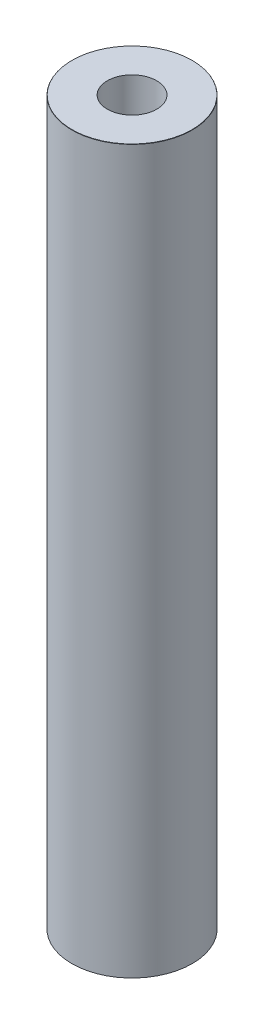
ISO-10303-21;
HEADER;
FILE_DESCRIPTION(('STEP AP214'),'2;1');
FILE_NAME('part.step','',(''),(''),'','','');
FILE_SCHEMA(('AUTOMOTIVE_DESIGN { 1 0 10303 214 1 1 1 1 }'));
ENDSEC;
DATA;
#1=APPLICATION_CONTEXT('core data for automotive mechanical design processes');
#2=APPLICATION_PROTOCOL_DEFINITION('international standard','automotive_design',2000,#1);
#3=PRODUCT_CONTEXT('',#1,'mechanical');
#4=PRODUCT('Part','Part','',(#3));
#5=PRODUCT_RELATED_PRODUCT_CATEGORY('part','',(#4));
#6=PRODUCT_DEFINITION_FORMATION('','',#4);
#7=PRODUCT_DEFINITION_CONTEXT('part definition',#1,'design');
#8=PRODUCT_DEFINITION('design','',#6,#7);
#9=PRODUCT_DEFINITION_SHAPE('','',#8);
#10=(LENGTH_UNIT() NAMED_UNIT(*) SI_UNIT(.MILLI.,.METRE.));
#11=(NAMED_UNIT(*) PLANE_ANGLE_UNIT() SI_UNIT($,.RADIAN.));
#12=(NAMED_UNIT(*) SI_UNIT($,.STERADIAN.) SOLID_ANGLE_UNIT());
#13=UNCERTAINTY_MEASURE_WITH_UNIT(LENGTH_MEASURE(1.E-05),#10,'distance_accuracy_value','');
#14=(GEOMETRIC_REPRESENTATION_CONTEXT(3) GLOBAL_UNCERTAINTY_ASSIGNED_CONTEXT((#13)) GLOBAL_UNIT_ASSIGNED_CONTEXT((#10,
#11,#12)) REPRESENTATION_CONTEXT('',''));
#15=CARTESIAN_POINT('',(0.,0.,0.));
#16=DIRECTION('',(0.,0.,1.));
#17=DIRECTION('',(1.,0.,0.));
#18=AXIS2_PLACEMENT_3D('',#15,#16,#17);
#19=CARTESIAN_POINT('',(0.,600.,0.));
#20=DIRECTION('',(0.,-1.,0.));
#21=DIRECTION('',(0.,0.,-1.));
#22=AXIS2_PLACEMENT_3D('',#19,#20,#21);
#23=CYLINDRICAL_SURFACE('',#22,50.);
#24=CARTESIAN_POINT('',(0.,599.776070791104,0.));
#25=DIRECTION('',(0.,1.,0.));
#26=DIRECTION('',(0.,0.,1.));
#27=AXIS2_PLACEMENT_3D('',#24,#25,#26);
#28=CIRCLE('',#27,50.);
#29=CARTESIAN_POINT('',(0.,599.776070791104,-50.));
#30=VERTEX_POINT('',#29);
#31=EDGE_CURVE('E50',#30,#30,#28,.F.);
#32=ORIENTED_EDGE('',*,*,#31,.T.);
#33=EDGE_LOOP('',(#32));
#34=FACE_BOUND('',#33,.T.);
#35=CARTESIAN_POINT('',(0.,0.12427134397941,0.));
#36=DIRECTION('',(0.,1.,0.));
#37=DIRECTION('',(0.,0.,1.));
#38=AXIS2_PLACEMENT_3D('',#35,#36,#37);
#39=CIRCLE('',#38,50.);
#40=CARTESIAN_POINT('',(0.,0.12427134397941,50.));
#41=VERTEX_POINT('',#40);
#42=EDGE_CURVE('E51',#41,#41,#39,.T.);
#43=ORIENTED_EDGE('',*,*,#42,.T.);
#44=EDGE_LOOP('',(#43));
#45=FACE_BOUND('',#44,.T.);
#46=ADVANCED_FACE('F39',(#34,#45),#23,.T.);
#47=CARTESIAN_POINT('',(0.,600.,0.));
#48=DIRECTION('',(0.,1.,0.));
#49=DIRECTION('',(0.,0.,1.));
#50=AXIS2_PLACEMENT_3D('',#47,#48,#49);
#51=PLANE('',#50);
#52=CARTESIAN_POINT('',(0.,600.,0.));
#53=DIRECTION('',(0.,1.,0.));
#54=DIRECTION('',(0.,0.,1.));
#55=AXIS2_PLACEMENT_3D('',#52,#53,#54);
#56=CIRCLE('',#55,49.8757286560205);
#57=CARTESIAN_POINT('',(0.,600.,-49.8757286560205));
#58=VERTEX_POINT('',#57);
#59=EDGE_CURVE('E54',#58,#58,#56,.T.);
#60=ORIENTED_EDGE('',*,*,#59,.T.);
#61=EDGE_LOOP('',(#60));
#62=FACE_BOUND('',#61,.T.);
#63=CARTESIAN_POINT('',(0.,600.,0.));
#64=DIRECTION('',(0.,1.,0.));
#65=DIRECTION('',(0.,0.,1.));
#66=AXIS2_PLACEMENT_3D('',#63,#64,#65);
#67=CIRCLE('',#66,20.5170093119604);
#68=CARTESIAN_POINT('',(0.,600.,20.5170093119604));
#69=VERTEX_POINT('',#68);
#70=EDGE_CURVE('E58',#69,#69,#67,.T.);
#71=ORIENTED_EDGE('',*,*,#70,.F.);
#72=EDGE_LOOP('',(#71));
#73=FACE_BOUND('',#72,.T.);
#74=ADVANCED_FACE('F69',(#62,#73),#51,.T.);
#75=CARTESIAN_POINT('',(0.,0.,0.));
#76=DIRECTION('',(0.,1.,0.));
#77=DIRECTION('',(0.,0.,1.));
#78=AXIS2_PLACEMENT_3D('',#75,#76,#77);
#79=PLANE('',#78);
#80=CARTESIAN_POINT('',(0.,0.,0.));
#81=DIRECTION('',(0.,1.,0.));
#82=DIRECTION('',(0.,0.,1.));
#83=AXIS2_PLACEMENT_3D('',#80,#81,#82);
#84=CIRCLE('',#83,49.7760707911039);
#85=CARTESIAN_POINT('',(0.,0.,49.7760707911039));
#86=VERTEX_POINT('',#85);
#87=EDGE_CURVE('E10',#86,#86,#84,.F.);
#88=ORIENTED_EDGE('',*,*,#87,.T.);
#89=EDGE_LOOP('',(#88));
#90=FACE_BOUND('',#89,.T.);
#91=CARTESIAN_POINT('',(0.,0.,0.));
#92=DIRECTION('',(0.,1.,0.));
#93=DIRECTION('',(0.,0.,1.));
#94=AXIS2_PLACEMENT_3D('',#91,#92,#93);
#95=CIRCLE('',#94,20.5170093119604);
#96=CARTESIAN_POINT('',(0.,0.,20.5170093119604));
#97=VERTEX_POINT('',#96);
#98=EDGE_CURVE('E63',#97,#97,#95,.T.);
#99=ORIENTED_EDGE('',*,*,#98,.T.);
#100=EDGE_LOOP('',(#99));
#101=FACE_BOUND('',#100,.T.);
#102=ADVANCED_FACE('F75',(#90,#101),#79,.F.);
#103=CARTESIAN_POINT('',(0.,600.,0.));
#104=DIRECTION('',(0.,-1.,0.));
#105=DIRECTION('',(0.,0.,-1.));
#106=AXIS2_PLACEMENT_3D('',#103,#104,#105);
#107=CYLINDRICAL_SURFACE('',#106,20.5170093119604);
#108=ORIENTED_EDGE('',*,*,#70,.T.);
#109=EDGE_LOOP('',(#108));
#110=FACE_BOUND('',#109,.T.);
#111=ORIENTED_EDGE('',*,*,#98,.F.);
#112=EDGE_LOOP('',(#111));
#113=FACE_BOUND('',#112,.T.);
#114=ADVANCED_FACE('F70',(#110,#113),#107,.F.);
#115=CARTESIAN_POINT('',(0.,600.,0.));
#116=DIRECTION('',(0.,-1.,0.));
#117=DIRECTION('',(0.,0.,-1.));
#118=AXIS2_PLACEMENT_3D('',#115,#116,#117);
#119=CONICAL_SURFACE('',#118,49.8757286560205,0.50664189589204);
#120=CARTESIAN_POINT('',(0.,599.776070791104,-50.));
#121=CARTESIAN_POINT('',(0.,599.77840338703,-49.9987055068336));
#122=CARTESIAN_POINT('',(0.,599.780735982956,-49.9974110136671));
#123=CARTESIAN_POINT('',(0.,599.785401174808,-49.9948220273342));
#124=CARTESIAN_POINT('',(0.,599.787733770734,-49.9935275341678));
#125=CARTESIAN_POINT('',(0.,599.792398962586,-49.9909385478349));
#126=CARTESIAN_POINT('',(0.,599.794731558512,-49.9896440546684));
#127=CARTESIAN_POINT('',(0.,599.799396750364,-49.9870550683355));
#128=CARTESIAN_POINT('',(0.,599.80172934629,-49.985760575169));
#129=CARTESIAN_POINT('',(0.,599.806394538142,-49.9831715888361));
#130=CARTESIAN_POINT('',(0.,599.808727134068,-49.9818770956697));
#131=CARTESIAN_POINT('',(0.,599.81339232592,-49.9792881093368));
#132=CARTESIAN_POINT('',(0.,599.815724921846,-49.9779936161703));
#133=CARTESIAN_POINT('',(0.,599.820390113698,-49.9754046298374));
#134=CARTESIAN_POINT('',(0.,599.822722709624,-49.974110136671));
#135=CARTESIAN_POINT('',(0.,599.827387901476,-49.9715211503381));
#136=CARTESIAN_POINT('',(0.,599.829720497402,-49.9702266571716));
#137=CARTESIAN_POINT('',(0.,599.834385689254,-49.9676376708387));
#138=CARTESIAN_POINT('',(0.,599.83671828518,-49.9663431776723));
#139=CARTESIAN_POINT('',(0.,599.841383477032,-49.9637541913394));
#140=CARTESIAN_POINT('',(0.,599.843716072958,-49.9624596981729));
#141=CARTESIAN_POINT('',(0.,599.84838126481,-49.95987071184));
#142=CARTESIAN_POINT('',(0.,599.850713860736,-49.9585762186735));
#143=CARTESIAN_POINT('',(0.,599.855379052588,-49.9559872323406));
#144=CARTESIAN_POINT('',(0.,599.857711648514,-49.9546927391742));
#145=CARTESIAN_POINT('',(0.,599.862376840366,-49.9521037528413));
#146=CARTESIAN_POINT('',(0.,599.864709436292,-49.9508092596748));
#147=CARTESIAN_POINT('',(0.,599.869374628144,-49.9482202733419));
#148=CARTESIAN_POINT('',(0.,599.87170722407,-49.9469257801755));
#149=CARTESIAN_POINT('',(0.,599.876372415922,-49.9443367938426));
#150=CARTESIAN_POINT('',(0.,599.878705011848,-49.9430423006761));
#151=CARTESIAN_POINT('',(0.,599.8833702037,-49.9404533143432));
#152=CARTESIAN_POINT('',(0.,599.885702799626,-49.9391588211767));
#153=CARTESIAN_POINT('',(0.,599.890367991478,-49.9365698348438));
#154=CARTESIAN_POINT('',(0.,599.892700587404,-49.9352753416774));
#155=CARTESIAN_POINT('',(0.,599.897365779256,-49.9326863553445));
#156=CARTESIAN_POINT('',(0.,599.899698375182,-49.931391862178));
#157=CARTESIAN_POINT('',(0.,599.904363567034,-49.9288028758451));
#158=CARTESIAN_POINT('',(0.,599.90669616296,-49.9275083826787));
#159=CARTESIAN_POINT('',(0.,599.911361354812,-49.9249193963458));
#160=CARTESIAN_POINT('',(0.,599.913693950738,-49.9236249031793));
#161=CARTESIAN_POINT('',(0.,599.91835914259,-49.9210359168464));
#162=CARTESIAN_POINT('',(0.,599.920691738516,-49.91974142368));
#163=CARTESIAN_POINT('',(0.,599.925356930368,-49.9171524373471));
#164=CARTESIAN_POINT('',(0.,599.927689526294,-49.9158579441806));
#165=CARTESIAN_POINT('',(0.,599.932354718146,-49.9132689578477));
#166=CARTESIAN_POINT('',(0.,599.934687314072,-49.9119744646812));
#167=CARTESIAN_POINT('',(0.,599.939352505924,-49.9093854783483));
#168=CARTESIAN_POINT('',(0.,599.94168510185,-49.9080909851819));
#169=CARTESIAN_POINT('',(0.,599.946350293702,-49.905501998849));
#170=CARTESIAN_POINT('',(0.,599.948682889628,-49.9042075056825));
#171=CARTESIAN_POINT('',(0.,599.95334808148,-49.9016185193496));
#172=CARTESIAN_POINT('',(0.,599.955680677406,-49.9003240261832));
#173=CARTESIAN_POINT('',(0.,599.960345869258,-49.8977350398503));
#174=CARTESIAN_POINT('',(0.,599.962678465184,-49.8964405466838));
#175=CARTESIAN_POINT('',(0.,599.967343657036,-49.8938515603509));
#176=CARTESIAN_POINT('',(0.,599.969676252962,-49.8925570671844));
#177=CARTESIAN_POINT('',(0.,599.974341444814,-49.8899680808515));
#178=CARTESIAN_POINT('',(0.,599.97667404074,-49.8886735876851));
#179=CARTESIAN_POINT('',(0.,599.981339232592,-49.8860846013522));
#180=CARTESIAN_POINT('',(0.,599.983671828518,-49.8847901081857));
#181=CARTESIAN_POINT('',(0.,599.98833702037,-49.8822011218528));
#182=CARTESIAN_POINT('',(0.,599.990669616296,-49.8809066286864));
#183=CARTESIAN_POINT('',(0.,599.995334808148,-49.8783176423535));
#184=CARTESIAN_POINT('',(0.,599.997667404074,-49.877023149187));
#185=CARTESIAN_POINT('',(0.,600.,-49.8757286560205));
#186=B_SPLINE_CURVE_WITH_KNOTS('',3,(#120,#121,#122,#123,#124,#125,#126,#127,#128,#129,#130,
#131,#132,#133,#134,#135,#136,#137,#138,#139,#140,#141,#142,#143,#144,#145,#146,#147,#148,#149,
#150,#151,#152,#153,#154,#155,#156,#157,#158,#159,#160,#161,#162,#163,#164,#165,#166,#167,#168,
#169,#170,#171,#172,#173,#174,#175,#176,#177,#178,#179,#180,#181,#182,#183,#184,#185),
.UNSPECIFIED.,.F.,.F.,(4,2,2,2,2,2,2,2,2,2,2,2,2,2,2,2,2,2,2,2,2,2,2,2,2,2,2,2,2,2,2,2,4),(0.,
0.00800315230444072,0.0160063046088848,0.0240094569133289,0.032012609217773,0.0400157615222171,
0.0480189138266578,0.0560220661311019,0.0640252184355459,0.07202837073999,0.0800315230444341,
0.0880346753487778,0.0960378276532219,0.104040979957666,0.11204413226211,0.120047284566554,
0.128050436870998,0.136053589175439,0.144056741479883,0.152059893784327,0.160063046088771,
0.168066198393215,0.176069350697559,0.184072503002003,0.192075655306447,0.200078807610891,
0.208081959915335,0.216085112219776,0.22408826452422,0.232091416828664,0.240094569133108,
0.248097721437552,0.256100873741996),.UNSPECIFIED.);
#187=EDGE_CURVE('BSEAM81',#30,#58,#186,.T.);
#188=ORIENTED_EDGE('',*,*,#31,.F.);
#189=ORIENTED_EDGE('',*,*,#59,.F.);
#190=ORIENTED_EDGE('',*,*,#187,.T.);
#191=ORIENTED_EDGE('',*,*,#187,.F.);
#192=EDGE_LOOP('',(#188,#190,#189,#191));
#193=FACE_BOUND('',#192,.T.);
#194=ADVANCED_FACE('F81',(#193),#119,.T.);
#195=CARTESIAN_POINT('',(0.,0.12427134397941,0.));
#196=DIRECTION('',(0.,1.,0.));
#197=DIRECTION('',(0.,0.,1.));
#198=AXIS2_PLACEMENT_3D('',#195,#196,#197);
#199=CONICAL_SURFACE('',#198,50.,1.06415443090291);
#200=ORIENTED_EDGE('',*,*,#87,.F.);
#201=EDGE_LOOP('',(#200));
#202=FACE_BOUND('',#201,.T.);
#203=ORIENTED_EDGE('',*,*,#42,.F.);
#204=EDGE_LOOP('',(#203));
#205=FACE_BOUND('',#204,.T.);
#206=ADVANCED_FACE('F45',(#202,#205),#199,.T.);
#207=CLOSED_SHELL('',(#46,#74,#102,#114,#194,#206));
#208=MANIFOLD_SOLID_BREP('B2',#207);
#209=ADVANCED_BREP_SHAPE_REPRESENTATION('',(#18,#208),#14);
#210=SHAPE_DEFINITION_REPRESENTATION(#9,#209);
ENDSEC;
END-ISO-10303-21;
